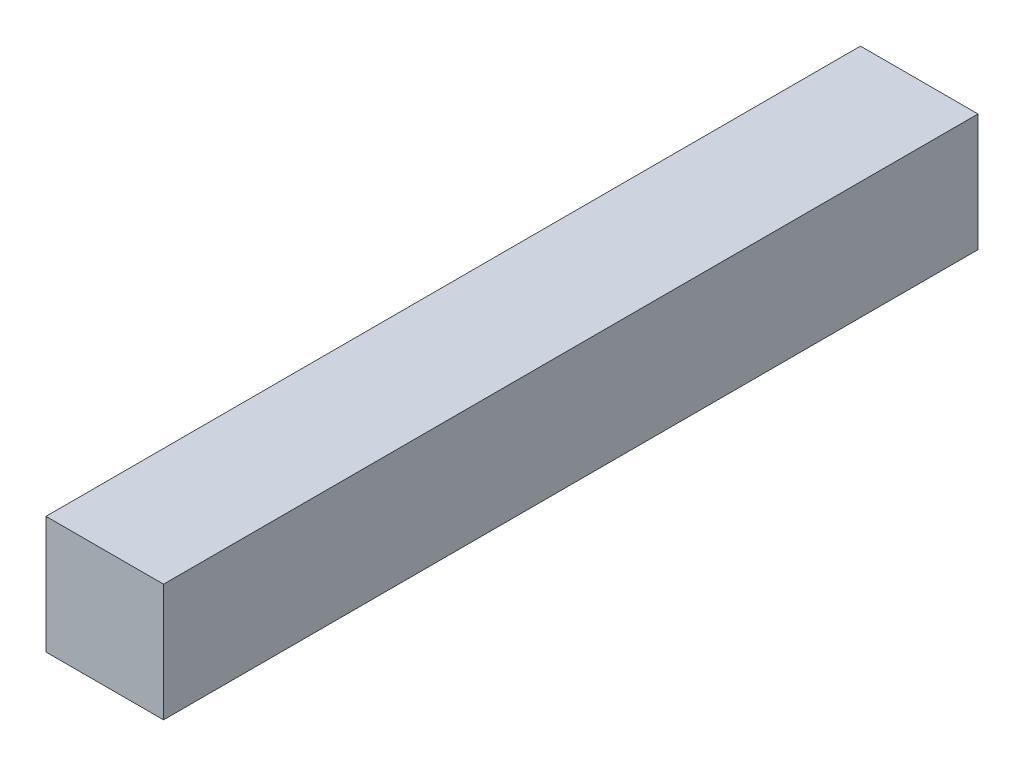
ISO-10303-21;
HEADER;
FILE_DESCRIPTION(('STEP AP214'),'2;1');
FILE_NAME('part.step','',(''),(''),'','','');
FILE_SCHEMA(('AUTOMOTIVE_DESIGN { 1 0 10303 214 1 1 1 1 }'));
ENDSEC;
DATA;
#1=APPLICATION_CONTEXT('core data for automotive mechanical design processes');
#2=APPLICATION_PROTOCOL_DEFINITION('international standard','automotive_design',2000,#1);
#3=PRODUCT_CONTEXT('',#1,'mechanical');
#4=PRODUCT('Part','Part','',(#3));
#5=PRODUCT_RELATED_PRODUCT_CATEGORY('part','',(#4));
#6=PRODUCT_DEFINITION_FORMATION('','',#4);
#7=PRODUCT_DEFINITION_CONTEXT('part definition',#1,'design');
#8=PRODUCT_DEFINITION('design','',#6,#7);
#9=PRODUCT_DEFINITION_SHAPE('','',#8);
#10=(LENGTH_UNIT() NAMED_UNIT(*) SI_UNIT(.MILLI.,.METRE.));
#11=(NAMED_UNIT(*) PLANE_ANGLE_UNIT() SI_UNIT($,.RADIAN.));
#12=(NAMED_UNIT(*) SI_UNIT($,.STERADIAN.) SOLID_ANGLE_UNIT());
#13=UNCERTAINTY_MEASURE_WITH_UNIT(LENGTH_MEASURE(1.E-05),#10,'distance_accuracy_value','');
#14=(GEOMETRIC_REPRESENTATION_CONTEXT(3) GLOBAL_UNCERTAINTY_ASSIGNED_CONTEXT((#13)) GLOBAL_UNIT_ASSIGNED_CONTEXT((#10,
#11,#12)) REPRESENTATION_CONTEXT('',''));
#15=CARTESIAN_POINT('',(0.,0.,0.));
#16=DIRECTION('',(0.,0.,1.));
#17=DIRECTION('',(1.,0.,0.));
#18=AXIS2_PLACEMENT_3D('',#15,#16,#17);
#19=CARTESIAN_POINT('',(3.175,-3.175,22.));
#20=DIRECTION('',(-1.,0.,0.));
#21=DIRECTION('',(0.,0.,1.));
#22=AXIS2_PLACEMENT_3D('',#19,#20,#21);
#23=PLANE('',#22);
#24=DIRECTION('',(0.,1.,0.));
#25=VECTOR('',#24,1.);
#26=CARTESIAN_POINT('',(3.175,-3.175,-22.));
#27=LINE('',#26,#25);
#28=CARTESIAN_POINT('',(3.175,-3.175,-22.));
#29=VERTEX_POINT('',#28);
#30=CARTESIAN_POINT('',(3.175,3.175,-22.));
#31=VERTEX_POINT('',#30);
#32=EDGE_CURVE('E102',#29,#31,#27,.T.);
#33=ORIENTED_EDGE('',*,*,#32,.T.);
#34=DIRECTION('',(0.,0.,-1.));
#35=VECTOR('',#34,1.);
#36=CARTESIAN_POINT('',(3.175,3.175,22.));
#37=LINE('',#36,#35);
#38=CARTESIAN_POINT('',(3.175,3.175,22.));
#39=VERTEX_POINT('',#38);
#40=EDGE_CURVE('E11',#39,#31,#37,.T.);
#41=ORIENTED_EDGE('',*,*,#40,.F.);
#42=DIRECTION('',(0.,1.,0.));
#43=VECTOR('',#42,1.);
#44=CARTESIAN_POINT('',(3.175,-3.175,22.));
#45=LINE('',#44,#43);
#46=CARTESIAN_POINT('',(3.175,-3.175,22.));
#47=VERTEX_POINT('',#46);
#48=EDGE_CURVE('E90',#47,#39,#45,.T.);
#49=ORIENTED_EDGE('',*,*,#48,.F.);
#50=DIRECTION('',(0.,0.,-1.));
#51=VECTOR('',#50,1.);
#52=CARTESIAN_POINT('',(3.175,-3.175,22.));
#53=LINE('',#52,#51);
#54=EDGE_CURVE('E98',#47,#29,#53,.T.);
#55=ORIENTED_EDGE('',*,*,#54,.T.);
#56=EDGE_LOOP('',(#33,#41,#49,#55));
#57=FACE_BOUND('',#56,.T.);
#58=ADVANCED_FACE('F39',(#57),#23,.F.);
#59=CARTESIAN_POINT('',(-3.175,3.175,22.));
#60=DIRECTION('',(0.,-1.,0.));
#61=DIRECTION('',(0.,0.,-1.));
#62=AXIS2_PLACEMENT_3D('',#59,#60,#61);
#63=PLANE('',#62);
#64=DIRECTION('',(-1.,0.,0.));
#65=VECTOR('',#64,1.);
#66=CARTESIAN_POINT('',(-3.175,3.175,-22.));
#67=LINE('',#66,#65);
#68=CARTESIAN_POINT('',(-3.175,3.175,-22.));
#69=VERTEX_POINT('',#68);
#70=EDGE_CURVE('E94',#31,#69,#67,.T.);
#71=ORIENTED_EDGE('',*,*,#70,.T.);
#72=DIRECTION('',(0.,0.,-1.));
#73=VECTOR('',#72,1.);
#74=CARTESIAN_POINT('',(-3.175,3.175,22.));
#75=LINE('',#74,#73);
#76=CARTESIAN_POINT('',(-3.175,3.175,22.));
#77=VERTEX_POINT('',#76);
#78=EDGE_CURVE('E47',#77,#69,#75,.T.);
#79=ORIENTED_EDGE('',*,*,#78,.F.);
#80=DIRECTION('',(-1.,0.,0.));
#81=VECTOR('',#80,1.);
#82=CARTESIAN_POINT('',(-3.175,3.175,22.));
#83=LINE('',#82,#81);
#84=EDGE_CURVE('E85',#39,#77,#83,.T.);
#85=ORIENTED_EDGE('',*,*,#84,.F.);
#86=ORIENTED_EDGE('',*,*,#40,.T.);
#87=EDGE_LOOP('',(#71,#79,#85,#86));
#88=FACE_BOUND('',#87,.T.);
#89=ADVANCED_FACE('F93',(#88),#63,.F.);
#90=CARTESIAN_POINT('',(-3.175,-3.175,22.));
#91=DIRECTION('',(1.,0.,0.));
#92=DIRECTION('',(0.,0.,-1.));
#93=AXIS2_PLACEMENT_3D('',#90,#91,#92);
#94=PLANE('',#93);
#95=DIRECTION('',(0.,-1.,0.));
#96=VECTOR('',#95,1.);
#97=CARTESIAN_POINT('',(-3.175,-3.175,-22.));
#98=LINE('',#97,#96);
#99=CARTESIAN_POINT('',(-3.175,-3.175,-22.));
#100=VERTEX_POINT('',#99);
#101=EDGE_CURVE('E72',#69,#100,#98,.T.);
#102=ORIENTED_EDGE('',*,*,#101,.T.);
#103=DIRECTION('',(0.,0.,-1.));
#104=VECTOR('',#103,1.);
#105=CARTESIAN_POINT('',(-3.175,-3.175,22.));
#106=LINE('',#105,#104);
#107=CARTESIAN_POINT('',(-3.175,-3.175,22.));
#108=VERTEX_POINT('',#107);
#109=EDGE_CURVE('E95',#108,#100,#106,.T.);
#110=ORIENTED_EDGE('',*,*,#109,.F.);
#111=DIRECTION('',(0.,-1.,0.));
#112=VECTOR('',#111,1.);
#113=CARTESIAN_POINT('',(-3.175,-3.175,22.));
#114=LINE('',#113,#112);
#115=EDGE_CURVE('E88',#77,#108,#114,.T.);
#116=ORIENTED_EDGE('',*,*,#115,.F.);
#117=ORIENTED_EDGE('',*,*,#78,.T.);
#118=EDGE_LOOP('',(#102,#110,#116,#117));
#119=FACE_BOUND('',#118,.T.);
#120=ADVANCED_FACE('F96',(#119),#94,.F.);
#121=CARTESIAN_POINT('',(-3.175,-3.175,22.));
#122=DIRECTION('',(0.,1.,0.));
#123=DIRECTION('',(0.,0.,1.));
#124=AXIS2_PLACEMENT_3D('',#121,#122,#123);
#125=PLANE('',#124);
#126=DIRECTION('',(1.,0.,0.));
#127=VECTOR('',#126,1.);
#128=CARTESIAN_POINT('',(-3.175,-3.175,-22.));
#129=LINE('',#128,#127);
#130=EDGE_CURVE('E78',#100,#29,#129,.T.);
#131=ORIENTED_EDGE('',*,*,#130,.T.);
#132=ORIENTED_EDGE('',*,*,#54,.F.);
#133=DIRECTION('',(1.,0.,0.));
#134=VECTOR('',#133,1.);
#135=CARTESIAN_POINT('',(-3.175,-3.175,22.));
#136=LINE('',#135,#134);
#137=EDGE_CURVE('E55',#108,#47,#136,.T.);
#138=ORIENTED_EDGE('',*,*,#137,.F.);
#139=ORIENTED_EDGE('',*,*,#109,.T.);
#140=EDGE_LOOP('',(#131,#132,#138,#139));
#141=FACE_BOUND('',#140,.T.);
#142=ADVANCED_FACE('F109',(#141),#125,.F.);
#143=CARTESIAN_POINT('',(0.,0.,22.));
#144=DIRECTION('',(0.,0.,-1.));
#145=DIRECTION('',(-1.,0.,0.));
#146=AXIS2_PLACEMENT_3D('',#143,#144,#145);
#147=PLANE('',#146);
#148=ORIENTED_EDGE('',*,*,#48,.T.);
#149=ORIENTED_EDGE('',*,*,#84,.T.);
#150=ORIENTED_EDGE('',*,*,#115,.T.);
#151=ORIENTED_EDGE('',*,*,#137,.T.);
#152=EDGE_LOOP('',(#148,#149,#150,#151));
#153=FACE_BOUND('',#152,.T.);
#154=ADVANCED_FACE('F86',(#153),#147,.F.);
#155=CARTESIAN_POINT('',(0.,0.,-22.));
#156=DIRECTION('',(0.,0.,-1.));
#157=DIRECTION('',(-1.,0.,0.));
#158=AXIS2_PLACEMENT_3D('',#155,#156,#157);
#159=PLANE('',#158);
#160=ORIENTED_EDGE('',*,*,#32,.F.);
#161=ORIENTED_EDGE('',*,*,#130,.F.);
#162=ORIENTED_EDGE('',*,*,#101,.F.);
#163=ORIENTED_EDGE('',*,*,#70,.F.);
#164=EDGE_LOOP('',(#160,#161,#162,#163));
#165=FACE_BOUND('',#164,.T.);
#166=ADVANCED_FACE('F112',(#165),#159,.T.);
#167=CLOSED_SHELL('',(#58,#89,#120,#142,#154,#166));
#168=MANIFOLD_SOLID_BREP('B2',#167);
#169=ADVANCED_BREP_SHAPE_REPRESENTATION('',(#18,#168),#14);
#170=SHAPE_DEFINITION_REPRESENTATION(#9,#169);
ENDSEC;
END-ISO-10303-21;
